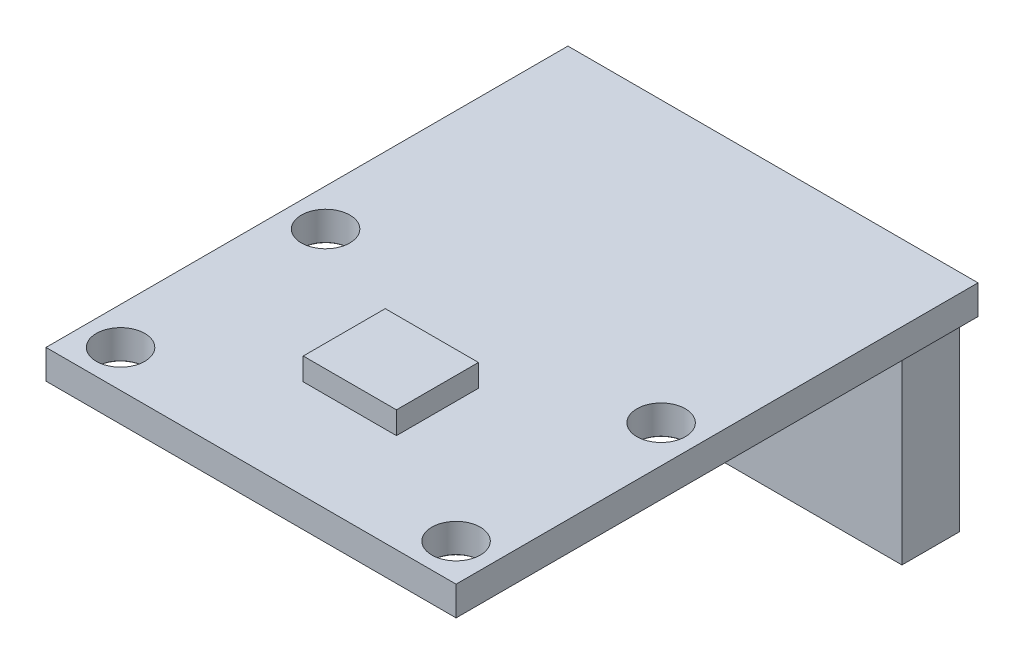
ISO-10303-21;
HEADER;
FILE_DESCRIPTION(('STEP AP214'),'2;1');
FILE_NAME('part.step','',(''),(''),'','','');
FILE_SCHEMA(('AUTOMOTIVE_DESIGN { 1 0 10303 214 1 1 1 1 }'));
ENDSEC;
DATA;
#1=APPLICATION_CONTEXT('core data for automotive mechanical design processes');
#2=APPLICATION_PROTOCOL_DEFINITION('international standard','automotive_design',2000,#1);
#3=PRODUCT_CONTEXT('',#1,'mechanical');
#4=PRODUCT('Part','Part','',(#3));
#5=PRODUCT_RELATED_PRODUCT_CATEGORY('part','',(#4));
#6=PRODUCT_DEFINITION_FORMATION('','',#4);
#7=PRODUCT_DEFINITION_CONTEXT('part definition',#1,'design');
#8=PRODUCT_DEFINITION('design','',#6,#7);
#9=PRODUCT_DEFINITION_SHAPE('','',#8);
#10=(LENGTH_UNIT() NAMED_UNIT(*) SI_UNIT(.MILLI.,.METRE.));
#11=(NAMED_UNIT(*) PLANE_ANGLE_UNIT() SI_UNIT($,.RADIAN.));
#12=(NAMED_UNIT(*) SI_UNIT($,.STERADIAN.) SOLID_ANGLE_UNIT());
#13=UNCERTAINTY_MEASURE_WITH_UNIT(LENGTH_MEASURE(1.E-05),#10,'distance_accuracy_value','');
#14=(GEOMETRIC_REPRESENTATION_CONTEXT(3) GLOBAL_UNCERTAINTY_ASSIGNED_CONTEXT((#13)) GLOBAL_UNIT_ASSIGNED_CONTEXT((#10,
#11,#12)) REPRESENTATION_CONTEXT('',''));
#15=CARTESIAN_POINT('',(0.,0.,0.));
#16=DIRECTION('',(0.,0.,1.));
#17=DIRECTION('',(1.,0.,0.));
#18=AXIS2_PLACEMENT_3D('',#15,#16,#17);
#19=CARTESIAN_POINT('',(0.,1.57,0.));
#20=DIRECTION('',(0.,1.,0.));
#21=DIRECTION('',(0.,0.,1.));
#22=AXIS2_PLACEMENT_3D('',#19,#20,#21);
#23=PLANE('',#22);
#24=CARTESIAN_POINT('',(-9.,1.57,-5.5));
#25=DIRECTION('',(0.,1.,0.));
#26=DIRECTION('',(0.,0.,1.));
#27=AXIS2_PLACEMENT_3D('',#24,#25,#26);
#28=CIRCLE('',#27,1.29999999999999);
#29=CARTESIAN_POINT('',(-9.,1.57,-4.20000000000001));
#30=VERTEX_POINT('',#29);
#31=EDGE_CURVE('E237',#30,#30,#28,.T.);
#32=ORIENTED_EDGE('',*,*,#31,.F.);
#33=EDGE_LOOP('',(#32));
#34=FACE_BOUND('',#33,.T.);
#35=CARTESIAN_POINT('',(-9.,1.57,5.5));
#36=DIRECTION('',(0.,1.,0.));
#37=DIRECTION('',(0.,0.,1.));
#38=AXIS2_PLACEMENT_3D('',#35,#36,#37);
#39=CIRCLE('',#38,1.29999999999999);
#40=CARTESIAN_POINT('',(-9.,1.57,6.79999999999999));
#41=VERTEX_POINT('',#40);
#42=EDGE_CURVE('E249',#41,#41,#39,.T.);
#43=ORIENTED_EDGE('',*,*,#42,.F.);
#44=EDGE_LOOP('',(#43));
#45=FACE_BOUND('',#44,.T.);
#46=CARTESIAN_POINT('',(9.,1.57,5.5));
#47=DIRECTION('',(0.,1.,0.));
#48=DIRECTION('',(0.,0.,1.));
#49=AXIS2_PLACEMENT_3D('',#46,#47,#48);
#50=CIRCLE('',#49,1.29999999999999);
#51=CARTESIAN_POINT('',(9.,1.57,6.79999999999999));
#52=VERTEX_POINT('',#51);
#53=EDGE_CURVE('E261',#52,#52,#50,.T.);
#54=ORIENTED_EDGE('',*,*,#53,.F.);
#55=EDGE_LOOP('',(#54));
#56=FACE_BOUND('',#55,.T.);
#57=CARTESIAN_POINT('',(9.,1.57,-5.5));
#58=DIRECTION('',(0.,1.,0.));
#59=DIRECTION('',(0.,0.,1.));
#60=AXIS2_PLACEMENT_3D('',#57,#58,#59);
#61=CIRCLE('',#60,1.29999999999999);
#62=CARTESIAN_POINT('',(9.,1.57,-4.20000000000001));
#63=VERTEX_POINT('',#62);
#64=EDGE_CURVE('E273',#63,#63,#61,.T.);
#65=ORIENTED_EDGE('',*,*,#64,.F.);
#66=EDGE_LOOP('',(#65));
#67=FACE_BOUND('',#66,.T.);
#68=DIRECTION('',(0.,0.,-1.));
#69=VECTOR('',#68,1.);
#70=CARTESIAN_POINT('',(11.,1.57,-20.5));
#71=LINE('',#70,#69);
#72=CARTESIAN_POINT('',(11.,1.57,7.5));
#73=VERTEX_POINT('',#72);
#74=CARTESIAN_POINT('',(11.,1.57,-20.5));
#75=VERTEX_POINT('',#74);
#76=EDGE_CURVE('E282',#73,#75,#71,.T.);
#77=ORIENTED_EDGE('',*,*,#76,.T.);
#78=DIRECTION('',(-1.,0.,0.));
#79=VECTOR('',#78,1.);
#80=CARTESIAN_POINT('',(-11.,1.57,-20.5));
#81=LINE('',#80,#79);
#82=CARTESIAN_POINT('',(-11.,1.57,-20.5));
#83=VERTEX_POINT('',#82);
#84=EDGE_CURVE('E286',#75,#83,#81,.T.);
#85=ORIENTED_EDGE('',*,*,#84,.T.);
#86=DIRECTION('',(0.,0.,1.));
#87=VECTOR('',#86,1.);
#88=CARTESIAN_POINT('',(-11.,1.57,-20.5));
#89=LINE('',#88,#87);
#90=CARTESIAN_POINT('',(-11.,1.57,7.5));
#91=VERTEX_POINT('',#90);
#92=EDGE_CURVE('E290',#83,#91,#89,.T.);
#93=ORIENTED_EDGE('',*,*,#92,.T.);
#94=DIRECTION('',(1.,0.,0.));
#95=VECTOR('',#94,1.);
#96=CARTESIAN_POINT('',(-11.,1.57,7.5));
#97=LINE('',#96,#95);
#98=EDGE_CURVE('E293',#91,#73,#97,.T.);
#99=ORIENTED_EDGE('',*,*,#98,.T.);
#100=EDGE_LOOP('',(#77,#85,#93,#99));
#101=FACE_BOUND('',#100,.T.);
#102=DIRECTION('',(-1.,0.,0.));
#103=VECTOR('',#102,1.);
#104=CARTESIAN_POINT('',(-2.5,1.57,-2.2));
#105=LINE('',#104,#103);
#106=CARTESIAN_POINT('',(2.5,1.57,-2.2));
#107=VERTEX_POINT('',#106);
#108=CARTESIAN_POINT('',(-2.5,1.57,-2.2));
#109=VERTEX_POINT('',#108);
#110=EDGE_CURVE('E213',#107,#109,#105,.T.);
#111=ORIENTED_EDGE('',*,*,#110,.F.);
#112=DIRECTION('',(0.,0.,-1.));
#113=VECTOR('',#112,1.);
#114=CARTESIAN_POINT('',(2.5,1.57,2.2));
#115=LINE('',#114,#113);
#116=CARTESIAN_POINT('',(2.5,1.57,2.2));
#117=VERTEX_POINT('',#116);
#118=EDGE_CURVE('E189',#117,#107,#115,.T.);
#119=ORIENTED_EDGE('',*,*,#118,.F.);
#120=DIRECTION('',(1.,0.,0.));
#121=VECTOR('',#120,1.);
#122=CARTESIAN_POINT('',(-2.5,1.57,2.2));
#123=LINE('',#122,#121);
#124=CARTESIAN_POINT('',(-2.5,1.57,2.2));
#125=VERTEX_POINT('',#124);
#126=EDGE_CURVE('E200',#125,#117,#123,.T.);
#127=ORIENTED_EDGE('',*,*,#126,.F.);
#128=DIRECTION('',(0.,0.,1.));
#129=VECTOR('',#128,1.);
#130=CARTESIAN_POINT('',(-2.5,1.57,2.2));
#131=LINE('',#130,#129);
#132=EDGE_CURVE('E216',#109,#125,#131,.T.);
#133=ORIENTED_EDGE('',*,*,#132,.F.);
#134=EDGE_LOOP('',(#111,#119,#127,#133));
#135=FACE_BOUND('',#134,.T.);
#136=ADVANCED_FACE('F51',(#34,#45,#56,#67,#101,#135),#23,.T.);
#137=CARTESIAN_POINT('',(11.,1.57,-20.5));
#138=DIRECTION('',(-1.,0.,0.));
#139=DIRECTION('',(0.,0.,1.));
#140=AXIS2_PLACEMENT_3D('',#137,#138,#139);
#141=PLANE('',#140);
#142=DIRECTION('',(0.,0.,-1.));
#143=VECTOR('',#142,1.);
#144=CARTESIAN_POINT('',(11.,0.,-20.5));
#145=LINE('',#144,#143);
#146=CARTESIAN_POINT('',(11.,0.,7.5));
#147=VERTEX_POINT('',#146);
#148=CARTESIAN_POINT('',(11.,0.,-20.5));
#149=VERTEX_POINT('',#148);
#150=EDGE_CURVE('E281',#147,#149,#145,.T.);
#151=ORIENTED_EDGE('',*,*,#150,.T.);
#152=DIRECTION('',(0.,-1.,0.));
#153=VECTOR('',#152,1.);
#154=CARTESIAN_POINT('',(11.,1.57,-20.5));
#155=LINE('',#154,#153);
#156=EDGE_CURVE('E11',#75,#149,#155,.T.);
#157=ORIENTED_EDGE('',*,*,#156,.F.);
#158=ORIENTED_EDGE('',*,*,#76,.F.);
#159=DIRECTION('',(0.,-1.,0.));
#160=VECTOR('',#159,1.);
#161=CARTESIAN_POINT('',(11.,1.57,7.5));
#162=LINE('',#161,#160);
#163=EDGE_CURVE('E296',#73,#147,#162,.T.);
#164=ORIENTED_EDGE('',*,*,#163,.T.);
#165=EDGE_LOOP('',(#151,#157,#158,#164));
#166=FACE_BOUND('',#165,.T.);
#167=ADVANCED_FACE('F53',(#166),#141,.F.);
#168=CARTESIAN_POINT('',(-11.,1.57,-20.5));
#169=DIRECTION('',(0.,0.,1.));
#170=DIRECTION('',(1.,0.,0.));
#171=AXIS2_PLACEMENT_3D('',#168,#169,#170);
#172=PLANE('',#171);
#173=DIRECTION('',(-1.,0.,0.));
#174=VECTOR('',#173,1.);
#175=CARTESIAN_POINT('',(-11.,0.,-20.5));
#176=LINE('',#175,#174);
#177=CARTESIAN_POINT('',(-11.,0.,-20.5));
#178=VERTEX_POINT('',#177);
#179=EDGE_CURVE('E300',#149,#178,#176,.T.);
#180=ORIENTED_EDGE('',*,*,#179,.T.);
#181=DIRECTION('',(0.,-1.,0.));
#182=VECTOR('',#181,1.);
#183=CARTESIAN_POINT('',(-11.,1.57,-20.5));
#184=LINE('',#183,#182);
#185=EDGE_CURVE('E60',#83,#178,#184,.T.);
#186=ORIENTED_EDGE('',*,*,#185,.F.);
#187=ORIENTED_EDGE('',*,*,#84,.F.);
#188=ORIENTED_EDGE('',*,*,#156,.T.);
#189=EDGE_LOOP('',(#180,#186,#187,#188));
#190=FACE_BOUND('',#189,.T.);
#191=ADVANCED_FACE('F336',(#190),#172,.F.);
#192=CARTESIAN_POINT('',(-11.,1.57,-20.5));
#193=DIRECTION('',(1.,0.,0.));
#194=DIRECTION('',(0.,0.,-1.));
#195=AXIS2_PLACEMENT_3D('',#192,#193,#194);
#196=PLANE('',#195);
#197=DIRECTION('',(0.,0.,1.));
#198=VECTOR('',#197,1.);
#199=CARTESIAN_POINT('',(-11.,0.,-20.5));
#200=LINE('',#199,#198);
#201=CARTESIAN_POINT('',(-11.,0.,7.5));
#202=VERTEX_POINT('',#201);
#203=EDGE_CURVE('E303',#178,#202,#200,.T.);
#204=ORIENTED_EDGE('',*,*,#203,.T.);
#205=DIRECTION('',(0.,-1.,0.));
#206=VECTOR('',#205,1.);
#207=CARTESIAN_POINT('',(-11.,1.57,7.5));
#208=LINE('',#207,#206);
#209=EDGE_CURVE('E311',#91,#202,#208,.T.);
#210=ORIENTED_EDGE('',*,*,#209,.F.);
#211=ORIENTED_EDGE('',*,*,#92,.F.);
#212=ORIENTED_EDGE('',*,*,#185,.T.);
#213=EDGE_LOOP('',(#204,#210,#211,#212));
#214=FACE_BOUND('',#213,.T.);
#215=ADVANCED_FACE('F320',(#214),#196,.F.);
#216=CARTESIAN_POINT('',(-11.,1.57,7.5));
#217=DIRECTION('',(0.,0.,-1.));
#218=DIRECTION('',(-1.,0.,0.));
#219=AXIS2_PLACEMENT_3D('',#216,#217,#218);
#220=PLANE('',#219);
#221=DIRECTION('',(1.,0.,0.));
#222=VECTOR('',#221,1.);
#223=CARTESIAN_POINT('',(-11.,0.,7.5));
#224=LINE('',#223,#222);
#225=EDGE_CURVE('E287',#202,#147,#224,.T.);
#226=ORIENTED_EDGE('',*,*,#225,.T.);
#227=ORIENTED_EDGE('',*,*,#163,.F.);
#228=ORIENTED_EDGE('',*,*,#98,.F.);
#229=ORIENTED_EDGE('',*,*,#209,.T.);
#230=EDGE_LOOP('',(#226,#227,#228,#229));
#231=FACE_BOUND('',#230,.T.);
#232=ADVANCED_FACE('F329',(#231),#220,.F.);
#233=CARTESIAN_POINT('',(0.,0.,0.));
#234=DIRECTION('',(0.,1.,0.));
#235=DIRECTION('',(0.,0.,1.));
#236=AXIS2_PLACEMENT_3D('',#233,#234,#235);
#237=PLANE('',#236);
#238=DIRECTION('',(-1.,0.,0.));
#239=VECTOR('',#238,1.);
#240=CARTESIAN_POINT('',(-10.5,0.,-20.));
#241=LINE('',#240,#239);
#242=CARTESIAN_POINT('',(10.5,0.,-20.));
#243=VERTEX_POINT('',#242);
#244=CARTESIAN_POINT('',(-10.5,0.,-20.));
#245=VERTEX_POINT('',#244);
#246=EDGE_CURVE('E170',#243,#245,#241,.T.);
#247=ORIENTED_EDGE('',*,*,#246,.T.);
#248=DIRECTION('',(0.,0.,1.));
#249=VECTOR('',#248,1.);
#250=CARTESIAN_POINT('',(-10.5,0.,-20.));
#251=LINE('',#250,#249);
#252=CARTESIAN_POINT('',(-10.5,0.,-16.92));
#253=VERTEX_POINT('',#252);
#254=EDGE_CURVE('E180',#245,#253,#251,.T.);
#255=ORIENTED_EDGE('',*,*,#254,.T.);
#256=DIRECTION('',(1.,0.,0.));
#257=VECTOR('',#256,1.);
#258=CARTESIAN_POINT('',(-10.5,0.,-16.92));
#259=LINE('',#258,#257);
#260=CARTESIAN_POINT('',(10.5,0.,-16.92));
#261=VERTEX_POINT('',#260);
#262=EDGE_CURVE('E147',#253,#261,#259,.T.);
#263=ORIENTED_EDGE('',*,*,#262,.T.);
#264=DIRECTION('',(0.,0.,-1.));
#265=VECTOR('',#264,1.);
#266=CARTESIAN_POINT('',(10.5,0.,-20.));
#267=LINE('',#266,#265);
#268=EDGE_CURVE('E67',#261,#243,#267,.T.);
#269=ORIENTED_EDGE('',*,*,#268,.T.);
#270=EDGE_LOOP('',(#247,#255,#263,#269));
#271=FACE_BOUND('',#270,.T.);
#272=CARTESIAN_POINT('',(-9.,0.,-5.5));
#273=DIRECTION('',(0.,1.,0.));
#274=DIRECTION('',(0.,0.,1.));
#275=AXIS2_PLACEMENT_3D('',#272,#273,#274);
#276=CIRCLE('',#275,1.325);
#277=CARTESIAN_POINT('',(-9.,0.,-4.175));
#278=VERTEX_POINT('',#277);
#279=EDGE_CURVE('E233',#278,#278,#276,.T.);
#280=ORIENTED_EDGE('',*,*,#279,.T.);
#281=EDGE_LOOP('',(#280));
#282=FACE_BOUND('',#281,.T.);
#283=CARTESIAN_POINT('',(-9.,0.,5.5));
#284=DIRECTION('',(0.,1.,0.));
#285=DIRECTION('',(0.,0.,1.));
#286=AXIS2_PLACEMENT_3D('',#283,#284,#285);
#287=CIRCLE('',#286,1.325);
#288=CARTESIAN_POINT('',(-9.,0.,6.825));
#289=VERTEX_POINT('',#288);
#290=EDGE_CURVE('E245',#289,#289,#287,.T.);
#291=ORIENTED_EDGE('',*,*,#290,.T.);
#292=EDGE_LOOP('',(#291));
#293=FACE_BOUND('',#292,.T.);
#294=CARTESIAN_POINT('',(9.,0.,5.5));
#295=DIRECTION('',(0.,1.,0.));
#296=DIRECTION('',(0.,0.,1.));
#297=AXIS2_PLACEMENT_3D('',#294,#295,#296);
#298=CIRCLE('',#297,1.325);
#299=CARTESIAN_POINT('',(9.,0.,6.825));
#300=VERTEX_POINT('',#299);
#301=EDGE_CURVE('E257',#300,#300,#298,.T.);
#302=ORIENTED_EDGE('',*,*,#301,.T.);
#303=EDGE_LOOP('',(#302));
#304=FACE_BOUND('',#303,.T.);
#305=CARTESIAN_POINT('',(9.,0.,-5.5));
#306=DIRECTION('',(0.,1.,0.));
#307=DIRECTION('',(0.,0.,1.));
#308=AXIS2_PLACEMENT_3D('',#305,#306,#307);
#309=CIRCLE('',#308,1.325);
#310=CARTESIAN_POINT('',(9.,0.,-4.175));
#311=VERTEX_POINT('',#310);
#312=EDGE_CURVE('E269',#311,#311,#309,.T.);
#313=ORIENTED_EDGE('',*,*,#312,.T.);
#314=EDGE_LOOP('',(#313));
#315=FACE_BOUND('',#314,.T.);
#316=ORIENTED_EDGE('',*,*,#150,.F.);
#317=ORIENTED_EDGE('',*,*,#225,.F.);
#318=ORIENTED_EDGE('',*,*,#203,.F.);
#319=ORIENTED_EDGE('',*,*,#179,.F.);
#320=EDGE_LOOP('',(#316,#317,#318,#319));
#321=FACE_BOUND('',#320,.T.);
#322=ADVANCED_FACE('F326',(#271,#282,#293,#304,#315,#321),#237,.F.);
#323=CARTESIAN_POINT('',(9.,0.0250000000000022,-5.5));
#324=DIRECTION('',(0.,-1.,0.));
#325=DIRECTION('',(0.,0.,-1.));
#326=AXIS2_PLACEMENT_3D('',#323,#324,#325);
#327=CONICAL_SURFACE('',#326,1.3,0.785398163397483);
#328=ORIENTED_EDGE('',*,*,#312,.F.);
#329=EDGE_LOOP('',(#328));
#330=FACE_BOUND('',#329,.T.);
#331=CARTESIAN_POINT('',(9.,0.0250000000000022,-5.5));
#332=DIRECTION('',(0.,1.,0.));
#333=DIRECTION('',(0.,0.,1.));
#334=AXIS2_PLACEMENT_3D('',#331,#332,#333);
#335=CIRCLE('',#334,1.3);
#336=CARTESIAN_POINT('',(9.,0.0250000000000022,-4.2));
#337=VERTEX_POINT('',#336);
#338=EDGE_CURVE('E277',#337,#337,#335,.T.);
#339=ORIENTED_EDGE('',*,*,#338,.T.);
#340=EDGE_LOOP('',(#339));
#341=FACE_BOUND('',#340,.T.);
#342=ADVANCED_FACE('F354',(#330,#341),#327,.F.);
#343=CARTESIAN_POINT('',(9.,1.57,-5.5));
#344=DIRECTION('',(0.,1.,0.));
#345=DIRECTION('',(0.,0.,1.));
#346=AXIS2_PLACEMENT_3D('',#343,#344,#345);
#347=CYLINDRICAL_SURFACE('',#346,1.29999999999999);
#348=ORIENTED_EDGE('',*,*,#338,.F.);
#349=EDGE_LOOP('',(#348));
#350=FACE_BOUND('',#349,.T.);
#351=ORIENTED_EDGE('',*,*,#64,.T.);
#352=EDGE_LOOP('',(#351));
#353=FACE_BOUND('',#352,.T.);
#354=ADVANCED_FACE('F372',(#350,#353),#347,.F.);
#355=CARTESIAN_POINT('',(9.,0.0250000000000022,5.5));
#356=DIRECTION('',(0.,-1.,0.));
#357=DIRECTION('',(0.,0.,-1.));
#358=AXIS2_PLACEMENT_3D('',#355,#356,#357);
#359=CONICAL_SURFACE('',#358,1.3,0.785398163397483);
#360=ORIENTED_EDGE('',*,*,#301,.F.);
#361=EDGE_LOOP('',(#360));
#362=FACE_BOUND('',#361,.T.);
#363=CARTESIAN_POINT('',(9.,0.0250000000000022,5.5));
#364=DIRECTION('',(0.,1.,0.));
#365=DIRECTION('',(0.,0.,1.));
#366=AXIS2_PLACEMENT_3D('',#363,#364,#365);
#367=CIRCLE('',#366,1.3);
#368=CARTESIAN_POINT('',(9.,0.0250000000000022,6.8));
#369=VERTEX_POINT('',#368);
#370=EDGE_CURVE('E265',#369,#369,#367,.T.);
#371=ORIENTED_EDGE('',*,*,#370,.T.);
#372=EDGE_LOOP('',(#371));
#373=FACE_BOUND('',#372,.T.);
#374=ADVANCED_FACE('F382',(#362,#373),#359,.F.);
#375=CARTESIAN_POINT('',(9.,1.57,5.5));
#376=DIRECTION('',(0.,1.,0.));
#377=DIRECTION('',(0.,0.,1.));
#378=AXIS2_PLACEMENT_3D('',#375,#376,#377);
#379=CYLINDRICAL_SURFACE('',#378,1.29999999999999);
#380=ORIENTED_EDGE('',*,*,#370,.F.);
#381=EDGE_LOOP('',(#380));
#382=FACE_BOUND('',#381,.T.);
#383=ORIENTED_EDGE('',*,*,#53,.T.);
#384=EDGE_LOOP('',(#383));
#385=FACE_BOUND('',#384,.T.);
#386=ADVANCED_FACE('F394',(#382,#385),#379,.F.);
#387=CARTESIAN_POINT('',(-9.,0.0250000000000022,5.5));
#388=DIRECTION('',(0.,-1.,0.));
#389=DIRECTION('',(0.,0.,-1.));
#390=AXIS2_PLACEMENT_3D('',#387,#388,#389);
#391=CONICAL_SURFACE('',#390,1.3,0.7853981633975);
#392=ORIENTED_EDGE('',*,*,#290,.F.);
#393=EDGE_LOOP('',(#392));
#394=FACE_BOUND('',#393,.T.);
#395=CARTESIAN_POINT('',(-9.,0.0250000000000022,5.5));
#396=DIRECTION('',(0.,1.,0.));
#397=DIRECTION('',(0.,0.,1.));
#398=AXIS2_PLACEMENT_3D('',#395,#396,#397);
#399=CIRCLE('',#398,1.3);
#400=CARTESIAN_POINT('',(-9.,0.0250000000000022,6.8));
#401=VERTEX_POINT('',#400);
#402=EDGE_CURVE('E253',#401,#401,#399,.T.);
#403=ORIENTED_EDGE('',*,*,#402,.T.);
#404=EDGE_LOOP('',(#403));
#405=FACE_BOUND('',#404,.T.);
#406=ADVANCED_FACE('F404',(#394,#405),#391,.F.);
#407=CARTESIAN_POINT('',(-9.,1.57,5.5));
#408=DIRECTION('',(0.,1.,0.));
#409=DIRECTION('',(0.,0.,1.));
#410=AXIS2_PLACEMENT_3D('',#407,#408,#409);
#411=CYLINDRICAL_SURFACE('',#410,1.29999999999999);
#412=ORIENTED_EDGE('',*,*,#402,.F.);
#413=EDGE_LOOP('',(#412));
#414=FACE_BOUND('',#413,.T.);
#415=ORIENTED_EDGE('',*,*,#42,.T.);
#416=EDGE_LOOP('',(#415));
#417=FACE_BOUND('',#416,.T.);
#418=ADVANCED_FACE('F416',(#414,#417),#411,.F.);
#419=CARTESIAN_POINT('',(-9.,0.0250000000000022,-5.5));
#420=DIRECTION('',(0.,-1.,0.));
#421=DIRECTION('',(0.,0.,-1.));
#422=AXIS2_PLACEMENT_3D('',#419,#420,#421);
#423=CONICAL_SURFACE('',#422,1.3,0.7853981633975);
#424=ORIENTED_EDGE('',*,*,#279,.F.);
#425=EDGE_LOOP('',(#424));
#426=FACE_BOUND('',#425,.T.);
#427=CARTESIAN_POINT('',(-9.,0.0250000000000022,-5.5));
#428=DIRECTION('',(0.,1.,0.));
#429=DIRECTION('',(0.,0.,1.));
#430=AXIS2_PLACEMENT_3D('',#427,#428,#429);
#431=CIRCLE('',#430,1.3);
#432=CARTESIAN_POINT('',(-9.,0.0250000000000022,-4.2));
#433=VERTEX_POINT('',#432);
#434=EDGE_CURVE('E241',#433,#433,#431,.T.);
#435=ORIENTED_EDGE('',*,*,#434,.T.);
#436=EDGE_LOOP('',(#435));
#437=FACE_BOUND('',#436,.T.);
#438=ADVANCED_FACE('F426',(#426,#437),#423,.F.);
#439=CARTESIAN_POINT('',(-9.,1.57,-5.5));
#440=DIRECTION('',(0.,1.,0.));
#441=DIRECTION('',(0.,0.,1.));
#442=AXIS2_PLACEMENT_3D('',#439,#440,#441);
#443=CYLINDRICAL_SURFACE('',#442,1.29999999999999);
#444=ORIENTED_EDGE('',*,*,#434,.F.);
#445=EDGE_LOOP('',(#444));
#446=FACE_BOUND('',#445,.T.);
#447=ORIENTED_EDGE('',*,*,#31,.T.);
#448=EDGE_LOOP('',(#447));
#449=FACE_BOUND('',#448,.T.);
#450=ADVANCED_FACE('F436',(#446,#449),#443,.F.);
#451=CARTESIAN_POINT('',(2.5,2.77,2.2));
#452=DIRECTION('',(-1.,0.,0.));
#453=DIRECTION('',(0.,0.,1.));
#454=AXIS2_PLACEMENT_3D('',#451,#452,#453);
#455=PLANE('',#454);
#456=ORIENTED_EDGE('',*,*,#118,.T.);
#457=DIRECTION('',(0.,-1.,0.));
#458=VECTOR('',#457,1.);
#459=CARTESIAN_POINT('',(2.5,2.77,-2.2));
#460=LINE('',#459,#458);
#461=CARTESIAN_POINT('',(2.5,2.77,-2.2));
#462=VERTEX_POINT('',#461);
#463=EDGE_CURVE('E230',#462,#107,#460,.T.);
#464=ORIENTED_EDGE('',*,*,#463,.F.);
#465=DIRECTION('',(0.,0.,-1.));
#466=VECTOR('',#465,1.);
#467=CARTESIAN_POINT('',(2.5,2.77,2.2));
#468=LINE('',#467,#466);
#469=CARTESIAN_POINT('',(2.5,2.77,2.2));
#470=VERTEX_POINT('',#469);
#471=EDGE_CURVE('E195',#470,#462,#468,.T.);
#472=ORIENTED_EDGE('',*,*,#471,.F.);
#473=DIRECTION('',(0.,-1.,0.));
#474=VECTOR('',#473,1.);
#475=CARTESIAN_POINT('',(2.5,2.77,2.2));
#476=LINE('',#475,#474);
#477=EDGE_CURVE('E209',#470,#117,#476,.T.);
#478=ORIENTED_EDGE('',*,*,#477,.T.);
#479=EDGE_LOOP('',(#456,#464,#472,#478));
#480=FACE_BOUND('',#479,.T.);
#481=ADVANCED_FACE('F445',(#480),#455,.F.);
#482=CARTESIAN_POINT('',(-2.5,2.77,-2.2));
#483=DIRECTION('',(0.,0.,1.));
#484=DIRECTION('',(1.,0.,0.));
#485=AXIS2_PLACEMENT_3D('',#482,#483,#484);
#486=PLANE('',#485);
#487=ORIENTED_EDGE('',*,*,#110,.T.);
#488=DIRECTION('',(0.,-1.,0.));
#489=VECTOR('',#488,1.);
#490=CARTESIAN_POINT('',(-2.5,2.77,-2.2));
#491=LINE('',#490,#489);
#492=CARTESIAN_POINT('',(-2.5,2.77,-2.2));
#493=VERTEX_POINT('',#492);
#494=EDGE_CURVE('E226',#493,#109,#491,.T.);
#495=ORIENTED_EDGE('',*,*,#494,.F.);
#496=DIRECTION('',(-1.,0.,0.));
#497=VECTOR('',#496,1.);
#498=CARTESIAN_POINT('',(-2.5,2.77,-2.2));
#499=LINE('',#498,#497);
#500=EDGE_CURVE('E199',#462,#493,#499,.T.);
#501=ORIENTED_EDGE('',*,*,#500,.F.);
#502=ORIENTED_EDGE('',*,*,#463,.T.);
#503=EDGE_LOOP('',(#487,#495,#501,#502));
#504=FACE_BOUND('',#503,.T.);
#505=ADVANCED_FACE('F461',(#504),#486,.F.);
#506=CARTESIAN_POINT('',(-2.5,2.77,2.2));
#507=DIRECTION('',(1.,0.,0.));
#508=DIRECTION('',(0.,0.,-1.));
#509=AXIS2_PLACEMENT_3D('',#506,#507,#508);
#510=PLANE('',#509);
#511=ORIENTED_EDGE('',*,*,#132,.T.);
#512=DIRECTION('',(0.,-1.,0.));
#513=VECTOR('',#512,1.);
#514=CARTESIAN_POINT('',(-2.5,2.77,2.2));
#515=LINE('',#514,#513);
#516=CARTESIAN_POINT('',(-2.5,2.77,2.2));
#517=VERTEX_POINT('',#516);
#518=EDGE_CURVE('E75',#517,#125,#515,.T.);
#519=ORIENTED_EDGE('',*,*,#518,.F.);
#520=DIRECTION('',(0.,0.,1.));
#521=VECTOR('',#520,1.);
#522=CARTESIAN_POINT('',(-2.5,2.77,2.2));
#523=LINE('',#522,#521);
#524=EDGE_CURVE('E203',#493,#517,#523,.T.);
#525=ORIENTED_EDGE('',*,*,#524,.F.);
#526=ORIENTED_EDGE('',*,*,#494,.T.);
#527=EDGE_LOOP('',(#511,#519,#525,#526));
#528=FACE_BOUND('',#527,.T.);
#529=ADVANCED_FACE('F471',(#528),#510,.F.);
#530=CARTESIAN_POINT('',(-2.5,2.77,2.2));
#531=DIRECTION('',(0.,0.,-1.));
#532=DIRECTION('',(-1.,0.,0.));
#533=AXIS2_PLACEMENT_3D('',#530,#531,#532);
#534=PLANE('',#533);
#535=ORIENTED_EDGE('',*,*,#126,.T.);
#536=ORIENTED_EDGE('',*,*,#477,.F.);
#537=DIRECTION('',(1.,0.,0.));
#538=VECTOR('',#537,1.);
#539=CARTESIAN_POINT('',(-2.5,2.77,2.2));
#540=LINE('',#539,#538);
#541=EDGE_CURVE('E206',#517,#470,#540,.T.);
#542=ORIENTED_EDGE('',*,*,#541,.F.);
#543=ORIENTED_EDGE('',*,*,#518,.T.);
#544=EDGE_LOOP('',(#535,#536,#542,#543));
#545=FACE_BOUND('',#544,.T.);
#546=ADVANCED_FACE('F481',(#545),#534,.F.);
#547=CARTESIAN_POINT('',(0.,2.77,0.));
#548=DIRECTION('',(0.,-1.,0.));
#549=DIRECTION('',(0.,0.,-1.));
#550=AXIS2_PLACEMENT_3D('',#547,#548,#549);
#551=PLANE('',#550);
#552=ORIENTED_EDGE('',*,*,#471,.T.);
#553=ORIENTED_EDGE('',*,*,#500,.T.);
#554=ORIENTED_EDGE('',*,*,#524,.T.);
#555=ORIENTED_EDGE('',*,*,#541,.T.);
#556=EDGE_LOOP('',(#552,#553,#554,#555));
#557=FACE_BOUND('',#556,.T.);
#558=ADVANCED_FACE('F491',(#557),#551,.F.);
#559=CARTESIAN_POINT('',(-10.5,-10.,-20.));
#560=DIRECTION('',(-1.,0.,0.));
#561=DIRECTION('',(0.,0.,1.));
#562=AXIS2_PLACEMENT_3D('',#559,#560,#561);
#563=PLANE('',#562);
#564=ORIENTED_EDGE('',*,*,#254,.F.);
#565=DIRECTION('',(0.,1.,0.));
#566=VECTOR('',#565,1.);
#567=CARTESIAN_POINT('',(-10.5,-10.,-20.));
#568=LINE('',#567,#566);
#569=CARTESIAN_POINT('',(-10.5,-10.,-20.));
#570=VERTEX_POINT('',#569);
#571=EDGE_CURVE('E168',#570,#245,#568,.T.);
#572=ORIENTED_EDGE('',*,*,#571,.F.);
#573=DIRECTION('',(0.,0.,1.));
#574=VECTOR('',#573,1.);
#575=CARTESIAN_POINT('',(-10.5,-10.,-20.));
#576=LINE('',#575,#574);
#577=CARTESIAN_POINT('',(-10.5,-10.,-16.92));
#578=VERTEX_POINT('',#577);
#579=EDGE_CURVE('E161',#570,#578,#576,.T.);
#580=ORIENTED_EDGE('',*,*,#579,.T.);
#581=DIRECTION('',(0.,1.,0.));
#582=VECTOR('',#581,1.);
#583=CARTESIAN_POINT('',(-10.5,-10.,-16.92));
#584=LINE('',#583,#582);
#585=EDGE_CURVE('E142',#578,#253,#584,.T.);
#586=ORIENTED_EDGE('',*,*,#585,.T.);
#587=EDGE_LOOP('',(#564,#572,#580,#586));
#588=FACE_BOUND('',#587,.T.);
#589=ADVANCED_FACE('F167',(#588),#563,.T.);
#590=CARTESIAN_POINT('',(-10.5,-10.,-20.));
#591=DIRECTION('',(0.,0.,-1.));
#592=DIRECTION('',(-1.,0.,0.));
#593=AXIS2_PLACEMENT_3D('',#590,#591,#592);
#594=PLANE('',#593);
#595=ORIENTED_EDGE('',*,*,#246,.F.);
#596=DIRECTION('',(0.,1.,0.));
#597=VECTOR('',#596,1.);
#598=CARTESIAN_POINT('',(10.5,-10.,-20.));
#599=LINE('',#598,#597);
#600=CARTESIAN_POINT('',(10.5,-10.,-20.));
#601=VERTEX_POINT('',#600);
#602=EDGE_CURVE('E190',#601,#243,#599,.T.);
#603=ORIENTED_EDGE('',*,*,#602,.F.);
#604=DIRECTION('',(-1.,0.,0.));
#605=VECTOR('',#604,1.);
#606=CARTESIAN_POINT('',(-10.5,-10.,-20.));
#607=LINE('',#606,#605);
#608=EDGE_CURVE('E154',#601,#570,#607,.T.);
#609=ORIENTED_EDGE('',*,*,#608,.T.);
#610=ORIENTED_EDGE('',*,*,#571,.T.);
#611=EDGE_LOOP('',(#595,#603,#609,#610));
#612=FACE_BOUND('',#611,.T.);
#613=ADVANCED_FACE('F509',(#612),#594,.T.);
#614=CARTESIAN_POINT('',(10.5,-10.,-20.));
#615=DIRECTION('',(1.,0.,0.));
#616=DIRECTION('',(0.,0.,-1.));
#617=AXIS2_PLACEMENT_3D('',#614,#615,#616);
#618=PLANE('',#617);
#619=ORIENTED_EDGE('',*,*,#268,.F.);
#620=DIRECTION('',(0.,1.,0.));
#621=VECTOR('',#620,1.);
#622=CARTESIAN_POINT('',(10.5,-10.,-16.92));
#623=LINE('',#622,#621);
#624=CARTESIAN_POINT('',(10.5,-10.,-16.92));
#625=VERTEX_POINT('',#624);
#626=EDGE_CURVE('E153',#625,#261,#623,.T.);
#627=ORIENTED_EDGE('',*,*,#626,.F.);
#628=DIRECTION('',(0.,0.,-1.));
#629=VECTOR('',#628,1.);
#630=CARTESIAN_POINT('',(10.5,-10.,-20.));
#631=LINE('',#630,#629);
#632=EDGE_CURVE('E164',#625,#601,#631,.T.);
#633=ORIENTED_EDGE('',*,*,#632,.T.);
#634=ORIENTED_EDGE('',*,*,#602,.T.);
#635=EDGE_LOOP('',(#619,#627,#633,#634));
#636=FACE_BOUND('',#635,.T.);
#637=ADVANCED_FACE('F518',(#636),#618,.T.);
#638=CARTESIAN_POINT('',(-10.5,-10.,-16.92));
#639=DIRECTION('',(0.,0.,1.));
#640=DIRECTION('',(1.,0.,0.));
#641=AXIS2_PLACEMENT_3D('',#638,#639,#640);
#642=PLANE('',#641);
#643=ORIENTED_EDGE('',*,*,#262,.F.);
#644=ORIENTED_EDGE('',*,*,#585,.F.);
#645=DIRECTION('',(1.,0.,0.));
#646=VECTOR('',#645,1.);
#647=CARTESIAN_POINT('',(-10.5,-10.,-16.92));
#648=LINE('',#647,#646);
#649=EDGE_CURVE('E145',#578,#625,#648,.T.);
#650=ORIENTED_EDGE('',*,*,#649,.T.);
#651=ORIENTED_EDGE('',*,*,#626,.T.);
#652=EDGE_LOOP('',(#643,#644,#650,#651));
#653=FACE_BOUND('',#652,.T.);
#654=ADVANCED_FACE('F144',(#653),#642,.T.);
#655=CARTESIAN_POINT('',(0.,-10.,0.));
#656=DIRECTION('',(0.,1.,0.));
#657=DIRECTION('',(0.,0.,1.));
#658=AXIS2_PLACEMENT_3D('',#655,#656,#657);
#659=PLANE('',#658);
#660=ORIENTED_EDGE('',*,*,#579,.F.);
#661=ORIENTED_EDGE('',*,*,#608,.F.);
#662=ORIENTED_EDGE('',*,*,#632,.F.);
#663=ORIENTED_EDGE('',*,*,#649,.F.);
#664=EDGE_LOOP('',(#660,#661,#662,#663));
#665=FACE_BOUND('',#664,.T.);
#666=ADVANCED_FACE('F159',(#665),#659,.F.);
#667=CLOSED_SHELL('',(#136,#167,#191,#215,#232,#322,#342,#354,#374,#386,#406,#418,#438,#450,
#481,#505,#529,#546,#558,#589,#613,#637,#654,#666));
#668=MANIFOLD_SOLID_BREP('B2',#667);
#669=ADVANCED_BREP_SHAPE_REPRESENTATION('',(#18,#668),#14);
#670=SHAPE_DEFINITION_REPRESENTATION(#9,#669);
ENDSEC;
END-ISO-10303-21;
